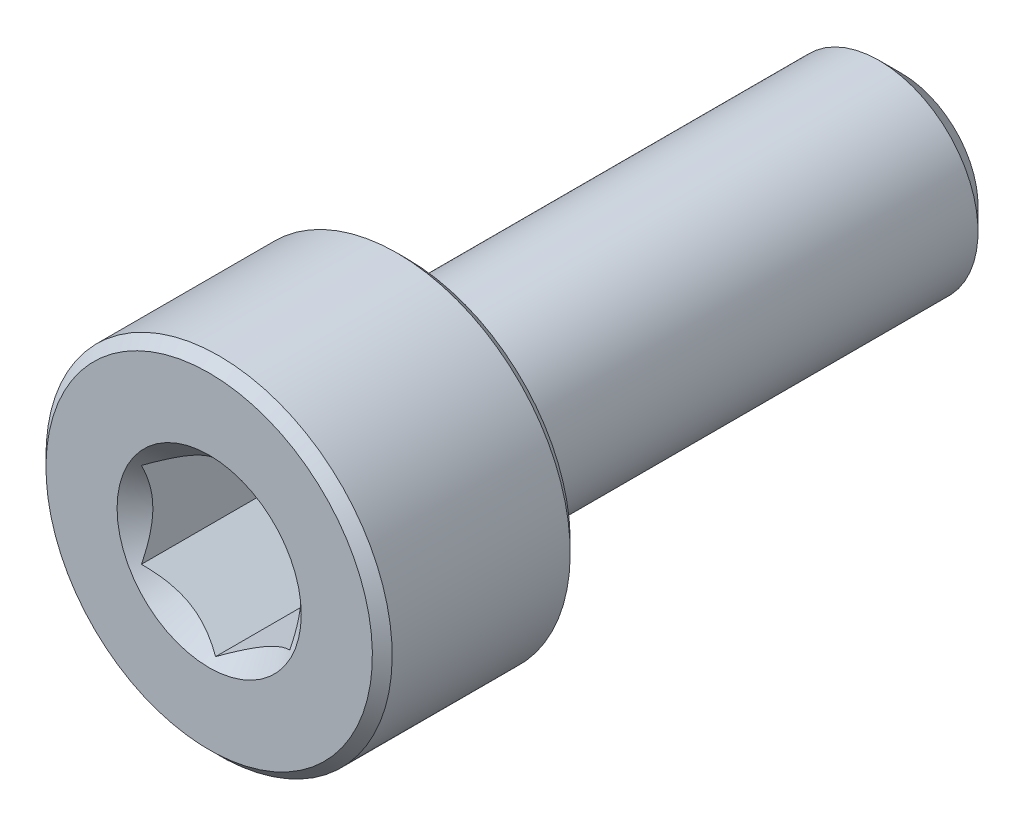
ISO-10303-21;
HEADER;
FILE_DESCRIPTION(('STEP AP214'),'2;1');
FILE_NAME('part.step','',(''),(''),'','','');
FILE_SCHEMA(('AUTOMOTIVE_DESIGN { 1 0 10303 214 1 1 1 1 }'));
ENDSEC;
DATA;
#1=APPLICATION_CONTEXT('core data for automotive mechanical design processes');
#2=APPLICATION_PROTOCOL_DEFINITION('international standard','automotive_design',2000,#1);
#3=PRODUCT_CONTEXT('',#1,'mechanical');
#4=PRODUCT('Part','Part','',(#3));
#5=PRODUCT_RELATED_PRODUCT_CATEGORY('part','',(#4));
#6=PRODUCT_DEFINITION_FORMATION('','',#4);
#7=PRODUCT_DEFINITION_CONTEXT('part definition',#1,'design');
#8=PRODUCT_DEFINITION('design','',#6,#7);
#9=PRODUCT_DEFINITION_SHAPE('','',#8);
#10=(LENGTH_UNIT() NAMED_UNIT(*) SI_UNIT(.MILLI.,.METRE.));
#11=(NAMED_UNIT(*) PLANE_ANGLE_UNIT() SI_UNIT($,.RADIAN.));
#12=(NAMED_UNIT(*) SI_UNIT($,.STERADIAN.) SOLID_ANGLE_UNIT());
#13=UNCERTAINTY_MEASURE_WITH_UNIT(LENGTH_MEASURE(1.E-05),#10,'distance_accuracy_value','');
#14=(GEOMETRIC_REPRESENTATION_CONTEXT(3) GLOBAL_UNCERTAINTY_ASSIGNED_CONTEXT((#13)) GLOBAL_UNIT_ASSIGNED_CONTEXT((#10,
#11,#12)) REPRESENTATION_CONTEXT('',''));
#15=CARTESIAN_POINT('',(0.,0.,0.));
#16=DIRECTION('',(0.,0.,1.));
#17=DIRECTION('',(1.,0.,0.));
#18=AXIS2_PLACEMENT_3D('',#15,#16,#17);
#19=CARTESIAN_POINT('',(0.,1.54533666301317,-7.));
#20=DIRECTION('',(0.,0.,-1.));
#21=DIRECTION('',(0.,1.,0.));
#22=AXIS2_PLACEMENT_3D('',#19,#20,#21);
#23=PLANE('',#22);
#24=CARTESIAN_POINT('',(0.,0.,-7.));
#25=DIRECTION('',(0.,0.,-1.));
#26=DIRECTION('',(0.,1.,0.));
#27=AXIS2_PLACEMENT_3D('',#24,#25,#26);
#28=CIRCLE('',#27,1.54533666301317);
#29=CARTESIAN_POINT('',(0.,1.54533666301317,-7.));
#30=VERTEX_POINT('',#29);
#31=EDGE_CURVE('E55',#30,#30,#28,.T.);
#32=ORIENTED_EDGE('',*,*,#31,.T.);
#33=EDGE_LOOP('',(#32));
#34=FACE_BOUND('',#33,.T.);
#35=ADVANCED_FACE('F41',(#34),#23,.T.);
#36=CARTESIAN_POINT('',(0.,0.,-7.));
#37=DIRECTION('',(0.,0.,1.));
#38=DIRECTION('',(0.,-1.,0.));
#39=AXIS2_PLACEMENT_3D('',#36,#37,#38);
#40=CONICAL_SURFACE('',#39,1.54533666301317,0.785398163397445);
#41=CARTESIAN_POINT('',(0.,0.,-6.54533666301317));
#42=DIRECTION('',(0.,0.,-1.));
#43=DIRECTION('',(0.,1.,0.));
#44=AXIS2_PLACEMENT_3D('',#41,#42,#43);
#45=CIRCLE('',#44,2.);
#46=CARTESIAN_POINT('',(0.,2.,-6.54533666301317));
#47=VERTEX_POINT('',#46);
#48=EDGE_CURVE('E173',#47,#47,#45,.T.);
#49=ORIENTED_EDGE('',*,*,#48,.T.);
#50=EDGE_LOOP('',(#49));
#51=FACE_BOUND('',#50,.T.);
#52=ORIENTED_EDGE('',*,*,#31,.F.);
#53=EDGE_LOOP('',(#52));
#54=FACE_BOUND('',#53,.T.);
#55=ADVANCED_FACE('F181',(#51,#54),#40,.T.);
#56=CARTESIAN_POINT('',(0.,0.,-7.));
#57=DIRECTION('',(0.,0.,-1.));
#58=DIRECTION('',(0.,1.,0.));
#59=AXIS2_PLACEMENT_3D('',#56,#57,#58);
#60=CYLINDRICAL_SURFACE('',#59,2.);
#61=CARTESIAN_POINT('',(0.,0.,2.8));
#62=DIRECTION('',(0.,0.,-1.));
#63=DIRECTION('',(0.,1.,0.));
#64=AXIS2_PLACEMENT_3D('',#61,#62,#63);
#65=CIRCLE('',#64,2.);
#66=CARTESIAN_POINT('',(0.,2.,2.8));
#67=VERTEX_POINT('',#66);
#68=EDGE_CURVE('E169',#67,#67,#65,.T.);
#69=ORIENTED_EDGE('',*,*,#68,.T.);
#70=EDGE_LOOP('',(#69));
#71=FACE_BOUND('',#70,.T.);
#72=ORIENTED_EDGE('',*,*,#48,.F.);
#73=EDGE_LOOP('',(#72));
#74=FACE_BOUND('',#73,.T.);
#75=ADVANCED_FACE('F183',(#71,#74),#60,.T.);
#76=CARTESIAN_POINT('',(0.,0.,2.8));
#77=DIRECTION('',(0.,0.,-1.));
#78=DIRECTION('',(0.,1.,0.));
#79=AXIS2_PLACEMENT_3D('',#76,#77,#78);
#80=TOROIDAL_SURFACE('',#79,2.2,0.2);
#81=CARTESIAN_POINT('',(0.,0.,3.));
#82=DIRECTION('',(0.,0.,-1.));
#83=DIRECTION('',(0.,1.,0.));
#84=AXIS2_PLACEMENT_3D('',#81,#82,#83);
#85=CIRCLE('',#84,2.2);
#86=CARTESIAN_POINT('',(0.,2.2,3.));
#87=VERTEX_POINT('',#86);
#88=EDGE_CURVE('E165',#87,#87,#85,.T.);
#89=ORIENTED_EDGE('',*,*,#88,.T.);
#90=EDGE_LOOP('',(#89));
#91=FACE_BOUND('',#90,.T.);
#92=ORIENTED_EDGE('',*,*,#68,.F.);
#93=EDGE_LOOP('',(#92));
#94=FACE_BOUND('',#93,.T.);
#95=ADVANCED_FACE('F189',(#91,#94),#80,.F.);
#96=CARTESIAN_POINT('',(0.,3.3,3.));
#97=DIRECTION('',(0.,0.,-1.));
#98=DIRECTION('',(0.,1.,0.));
#99=AXIS2_PLACEMENT_3D('',#96,#97,#98);
#100=PLANE('',#99);
#101=CARTESIAN_POINT('',(0.,0.,3.));
#102=DIRECTION('',(0.,0.,-1.));
#103=DIRECTION('',(0.,1.,0.));
#104=AXIS2_PLACEMENT_3D('',#101,#102,#103);
#105=CIRCLE('',#104,3.3);
#106=CARTESIAN_POINT('',(0.,3.3,3.));
#107=VERTEX_POINT('',#106);
#108=EDGE_CURVE('E161',#107,#107,#105,.T.);
#109=ORIENTED_EDGE('',*,*,#108,.T.);
#110=EDGE_LOOP('',(#109));
#111=FACE_BOUND('',#110,.T.);
#112=ORIENTED_EDGE('',*,*,#88,.F.);
#113=EDGE_LOOP('',(#112));
#114=FACE_BOUND('',#113,.T.);
#115=ADVANCED_FACE('F195',(#111,#114),#100,.T.);
#116=CARTESIAN_POINT('',(0.,0.,3.));
#117=DIRECTION('',(0.,0.,1.));
#118=DIRECTION('',(0.,-1.,0.));
#119=AXIS2_PLACEMENT_3D('',#116,#117,#118);
#120=CONICAL_SURFACE('',#119,3.3,0.785398163397447);
#121=CARTESIAN_POINT('',(0.,0.,3.2));
#122=DIRECTION('',(0.,0.,-1.));
#123=DIRECTION('',(0.,1.,0.));
#124=AXIS2_PLACEMENT_3D('',#121,#122,#123);
#125=CIRCLE('',#124,3.5);
#126=CARTESIAN_POINT('',(0.,3.5,3.2));
#127=VERTEX_POINT('',#126);
#128=EDGE_CURVE('E157',#127,#127,#125,.T.);
#129=ORIENTED_EDGE('',*,*,#128,.T.);
#130=EDGE_LOOP('',(#129));
#131=FACE_BOUND('',#130,.T.);
#132=ORIENTED_EDGE('',*,*,#108,.F.);
#133=EDGE_LOOP('',(#132));
#134=FACE_BOUND('',#133,.T.);
#135=ADVANCED_FACE('F199',(#131,#134),#120,.T.);
#136=CARTESIAN_POINT('',(0.,0.,-7.));
#137=DIRECTION('',(0.,0.,-1.));
#138=DIRECTION('',(0.,1.,0.));
#139=AXIS2_PLACEMENT_3D('',#136,#137,#138);
#140=CYLINDRICAL_SURFACE('',#139,3.5);
#141=CARTESIAN_POINT('',(0.,0.,6.8));
#142=DIRECTION('',(0.,0.,-1.));
#143=DIRECTION('',(0.,1.,0.));
#144=AXIS2_PLACEMENT_3D('',#141,#142,#143);
#145=CIRCLE('',#144,3.5);
#146=CARTESIAN_POINT('',(0.,3.5,6.8));
#147=VERTEX_POINT('',#146);
#148=EDGE_CURVE('E153',#147,#147,#145,.T.);
#149=ORIENTED_EDGE('',*,*,#148,.T.);
#150=EDGE_LOOP('',(#149));
#151=FACE_BOUND('',#150,.T.);
#152=ORIENTED_EDGE('',*,*,#128,.F.);
#153=EDGE_LOOP('',(#152));
#154=FACE_BOUND('',#153,.T.);
#155=ADVANCED_FACE('F203',(#151,#154),#140,.T.);
#156=CARTESIAN_POINT('',(0.,0.,6.8));
#157=DIRECTION('',(0.,0.,-1.));
#158=DIRECTION('',(0.,1.,0.));
#159=AXIS2_PLACEMENT_3D('',#156,#157,#158);
#160=CONICAL_SURFACE('',#159,3.5,0.785398163397447);
#161=CARTESIAN_POINT('',(0.,0.,7.));
#162=DIRECTION('',(0.,0.,-1.));
#163=DIRECTION('',(0.,1.,0.));
#164=AXIS2_PLACEMENT_3D('',#161,#162,#163);
#165=CIRCLE('',#164,3.3);
#166=CARTESIAN_POINT('',(0.,3.3,7.));
#167=VERTEX_POINT('',#166);
#168=EDGE_CURVE('E149',#167,#167,#165,.T.);
#169=ORIENTED_EDGE('',*,*,#168,.T.);
#170=EDGE_LOOP('',(#169));
#171=FACE_BOUND('',#170,.T.);
#172=ORIENTED_EDGE('',*,*,#148,.F.);
#173=EDGE_LOOP('',(#172));
#174=FACE_BOUND('',#173,.T.);
#175=ADVANCED_FACE('F207',(#171,#174),#160,.T.);
#176=CARTESIAN_POINT('',(0.,0.,7.));
#177=DIRECTION('',(0.,0.,1.));
#178=DIRECTION('',(0.,-1.,0.));
#179=AXIS2_PLACEMENT_3D('',#176,#177,#178);
#180=PLANE('',#179);
#181=CARTESIAN_POINT('',(0.,0.,7.));
#182=DIRECTION('',(0.,0.,1.));
#183=DIRECTION('',(1.,0.,0.));
#184=AXIS2_PLACEMENT_3D('',#181,#182,#183);
#185=CIRCLE('',#184,1.86195461813654);
#186=CARTESIAN_POINT('',(1.86195461813654,0.,7.));
#187=VERTEX_POINT('',#186);
#188=EDGE_CURVE('E115',#187,#187,#185,.T.);
#189=ORIENTED_EDGE('',*,*,#188,.F.);
#190=EDGE_LOOP('',(#189));
#191=FACE_BOUND('',#190,.T.);
#192=ORIENTED_EDGE('',*,*,#168,.F.);
#193=EDGE_LOOP('',(#192));
#194=FACE_BOUND('',#193,.T.);
#195=ADVANCED_FACE('F211',(#191,#194),#180,.T.);
#196=CARTESIAN_POINT('',(0.,0.,7.));
#197=DIRECTION('',(0.,0.,1.));
#198=DIRECTION('',(1.,0.,0.));
#199=AXIS2_PLACEMENT_3D('',#196,#197,#198);
#200=CONICAL_SURFACE('',#199,1.86195461813654,0.78539816339745);
#201=ORIENTED_EDGE('',*,*,#188,.T.);
#202=EDGE_LOOP('',(#201));
#203=FACE_BOUND('',#202,.T.);
#204=CARTESIAN_POINT('',(-0.000199999999999562,-1.73216627762272,6.87021167103241));
#205=CARTESIAN_POINT('',(0.051367790737076,-1.70239359975915,6.84046166549966));
#206=CARTESIAN_POINT('',(0.103797917665201,-1.67212305186355,6.81245867334265));
#207=CARTESIAN_POINT('',(0.210709034055597,-1.61039789003619,6.76118541987248));
#208=CARTESIAN_POINT('',(0.265200195814661,-1.57893740312614,6.73794369447671));
#209=CARTESIAN_POINT('',(0.375079081357249,-1.51549879897987,6.69812991842456));
#210=CARTESIAN_POINT('',(0.4304388090952,-1.4835368452681,6.68145777510323));
#211=CARTESIAN_POINT('',(0.542377257477151,-1.41890915196211,6.65577064625044));
#212=CARTESIAN_POINT('',(0.598952556553009,-1.38624538781118,6.6467364799112));
#213=CARTESIAN_POINT('',(0.696455389516441,-1.32995210095299,6.63858527065919));
#214=CARTESIAN_POINT('',(0.737256908280467,-1.30639533311124,6.63737844242155));
#215=CARTESIAN_POINT('',(0.818787969615859,-1.25932335290193,6.6394102465946));
#216=CARTESIAN_POINT('',(0.859517494314631,-1.23580815085313,6.64264986018064));
#217=CARTESIAN_POINT('',(0.940584402163417,-1.18900414978427,6.6533881754143));
#218=CARTESIAN_POINT('',(0.980921384598289,-1.1657155821172,6.66089084245107));
#219=CARTESIAN_POINT('',(1.06091833691403,-1.11952932016335,6.67974780136063));
#220=CARTESIAN_POINT('',(1.10057800851621,-1.09663179808786,6.69110374645092));
#221=CARTESIAN_POINT('',(1.20216313477449,-1.03798159809698,6.72481783702501));
#222=CARTESIAN_POINT('',(1.26345855370969,-1.00259267147465,6.7497180385257));
#223=CARTESIAN_POINT('',(1.35358562846331,-0.950557780604375,6.79175284270391));
#224=CARTESIAN_POINT('',(1.38328513990772,-0.933410759677147,6.80652134299143));
#225=CARTESIAN_POINT('',(1.44213790138375,-0.899432101996407,6.8374067553725));
#226=CARTESIAN_POINT('',(1.47129140422064,-0.88260031928571,6.85352302355405));
#227=CARTESIAN_POINT('',(1.5002,-0.865909933730601,6.87021167103241));
#228=B_SPLINE_CURVE_WITH_KNOTS('',3,(#204,#205,#206,#207,#208,#209,#210,#211,#212,#213,#214,
#215,#216,#217,#218,#219,#220,#221,#222,#223,#224,#225,#226,#227),.UNSPECIFIED.,.F.,.F.,(4,2,2,
2,2,2,2,2,2,2,2,4),(0.,0.199829143693305,0.400822987382388,0.598623720538181,0.79592624018889,
0.937113067959882,1.07833105577193,1.21968061668222,1.36109089931054,1.58570969637565,
1.69770705470964,1.80965120737194),.UNSPECIFIED.);
#229=CARTESIAN_POINT('',(0.,-1.73205080756888,6.87009618943233));
#230=VERTEX_POINT('',#229);
#231=CARTESIAN_POINT('',(1.5,-0.866025403784439,6.87009618943233));
#232=VERTEX_POINT('',#231);
#233=EDGE_CURVE('E12',#230,#232,#228,.T.);
#234=ORIENTED_EDGE('',*,*,#233,.F.);
#235=CARTESIAN_POINT('',(-1.5002,-0.865909933730601,6.87021167103241));
#236=CARTESIAN_POINT('',(-1.44863220926292,-0.895682611594166,6.84046166549966));
#237=CARTESIAN_POINT('',(-1.3962020823348,-0.925953159489765,6.81245867334265));
#238=CARTESIAN_POINT('',(-1.2892909659444,-0.987678321317124,6.76118541987248));
#239=CARTESIAN_POINT('',(-1.23479980418534,-1.01913880822718,6.73794369447671));
#240=CARTESIAN_POINT('',(-1.12492091864275,-1.08257741237344,6.69812991842456));
#241=CARTESIAN_POINT('',(-1.0695611909048,-1.11453936608521,6.68145777510323));
#242=CARTESIAN_POINT('',(-0.957622742522849,-1.1791670593912,6.65577064625044));
#243=CARTESIAN_POINT('',(-0.901047443446991,-1.21183082354213,6.6467364799112));
#244=CARTESIAN_POINT('',(-0.803544610483559,-1.26812411040032,6.63858527065919));
#245=CARTESIAN_POINT('',(-0.762743091719534,-1.29168087824208,6.63737844242155));
#246=CARTESIAN_POINT('',(-0.681212030384142,-1.33875285845138,6.6394102465946));
#247=CARTESIAN_POINT('',(-0.64048250568537,-1.36226806050018,6.64264986018064));
#248=CARTESIAN_POINT('',(-0.559415597836584,-1.40907206156905,6.6533881754143));
#249=CARTESIAN_POINT('',(-0.519078615401712,-1.43236062923612,6.66089084245107));
#250=CARTESIAN_POINT('',(-0.439081663085969,-1.47854689118996,6.67974780136063));
#251=CARTESIAN_POINT('',(-0.399421991483792,-1.50144441326545,6.69110374645092));
#252=CARTESIAN_POINT('',(-0.297836865225515,-1.56009461325633,6.72481783702501));
#253=CARTESIAN_POINT('',(-0.236541446290311,-1.59548353987866,6.7497180385257));
#254=CARTESIAN_POINT('',(-0.146414371536686,-1.64751843074894,6.79175284270391));
#255=CARTESIAN_POINT('',(-0.116714860092282,-1.66466545167617,6.80652134299143));
#256=CARTESIAN_POINT('',(-0.0578620986162482,-1.69864410935691,6.8374067553725));
#257=CARTESIAN_POINT('',(-0.0287085957793619,-1.71547589206761,6.85352302355405));
#258=CARTESIAN_POINT('',(0.00020000000000074,-1.73216627762272,6.87021167103241));
#259=B_SPLINE_CURVE_WITH_KNOTS('',3,(#235,#236,#237,#238,#239,#240,#241,#242,#243,#244,#245,
#246,#247,#248,#249,#250,#251,#252,#253,#254,#255,#256,#257,#258),.UNSPECIFIED.,.F.,.F.,(4,2,2,
2,2,2,2,2,2,2,2,4),(0.,0.199829143693305,0.400822987382388,0.598623720538181,0.795926240188889,
0.937113067959881,1.07833105577193,1.21968061668222,1.36109089931054,1.58570969637566,
1.69770705470964,1.80965120737194),.UNSPECIFIED.);
#260=CARTESIAN_POINT('',(-1.5,-0.866025403784439,6.87009618943233));
#261=VERTEX_POINT('',#260);
#262=EDGE_CURVE('E100',#261,#230,#259,.T.);
#263=ORIENTED_EDGE('',*,*,#262,.F.);
#264=CARTESIAN_POINT('',(-1.5,-1.81798631684901,7.49496588290931));
#265=CARTESIAN_POINT('',(-1.5,-1.77410479833239,7.46112335419702));
#266=CARTESIAN_POINT('',(-1.5,-1.72998897047494,7.42758561768896));
#267=CARTESIAN_POINT('',(-1.5,-1.64119029432319,7.36124817349269));
#268=CARTESIAN_POINT('',(-1.5,-1.59650731534755,7.328448640911));
#269=CARTESIAN_POINT('',(-1.5,-1.460806940489,7.23088193148043));
#270=CARTESIAN_POINT('',(-1.5,-1.36880251235632,7.1674654206559));
#271=CARTESIAN_POINT('',(-1.5,-1.17526237686872,7.04210237172158));
#272=CARTESIAN_POINT('',(-1.5,-1.07349393006072,6.98051141536721));
#273=CARTESIAN_POINT('',(-1.5,-0.864764842560627,6.86725220599653));
#274=CARTESIAN_POINT('',(-1.5,-0.757823334449949,6.81555043950584));
#275=CARTESIAN_POINT('',(-1.5,-0.598146069886858,6.75227317361643));
#276=CARTESIAN_POINT('',(-1.5,-0.547969945491557,6.73427408399124));
#277=CARTESIAN_POINT('',(-1.5,-0.446326869364774,6.70229546522083));
#278=CARTESIAN_POINT('',(-1.5,-0.394859836419925,6.68831618966241));
#279=CARTESIAN_POINT('',(-1.5,-0.291848397493325,6.66536569037263));
#280=CARTESIAN_POINT('',(-1.5,-0.240324749628771,6.65630281543282));
#281=CARTESIAN_POINT('',(-1.5,-0.13662544851591,6.64337711521516));
#282=CARTESIAN_POINT('',(-1.5,-0.0844499362377799,6.6395131846234));
#283=CARTESIAN_POINT('',(-1.5,0.0176806967011132,6.63731961256892));
#284=CARTESIAN_POINT('',(-1.5,0.0676307045116617,6.63875006923659));
#285=CARTESIAN_POINT('',(-1.5,0.16714547763776,6.64651331423855));
#286=CARTESIAN_POINT('',(-1.5,0.216710207908513,6.6528465433779));
#287=CARTESIAN_POINT('',(-1.5,0.315937150651982,6.67016271707146));
#288=CARTESIAN_POINT('',(-1.5,0.365584733694539,6.68122815181031));
#289=CARTESIAN_POINT('',(-1.5,0.46378160619877,6.70739349919908));
#290=CARTESIAN_POINT('',(-1.5,0.512330953840259,6.72249319758548));
#291=CARTESIAN_POINT('',(-1.5,0.66131302328769,6.77461385569168));
#292=CARTESIAN_POINT('',(-1.5,0.759720789706277,6.81740496304236));
#293=CARTESIAN_POINT('',(-1.5,0.95194266902277,6.91263883721007));
#294=CARTESIAN_POINT('',(-1.5,1.04573912191844,6.96511552648595));
#295=CARTESIAN_POINT('',(-1.5,1.22504153577549,7.0734783373155));
#296=CARTESIAN_POINT('',(-1.5,1.3107282773288,7.12906910554414));
#297=CARTESIAN_POINT('',(-1.5,1.43696960041027,7.21505045621636));
#298=CARTESIAN_POINT('',(-1.5,1.47850725450332,7.24402268297088));
#299=CARTESIAN_POINT('',(-1.5,1.56101250374723,7.30274488393776));
#300=CARTESIAN_POINT('',(-1.5,1.60198025290925,7.33249464151831));
#301=CARTESIAN_POINT('',(-1.5,1.64271029717086,7.36256715528604));
#302=B_SPLINE_CURVE_WITH_KNOTS('',3,(#264,#265,#266,#267,#268,#269,#270,#271,#272,#273,#274,
#275,#276,#277,#278,#279,#280,#281,#282,#283,#284,#285,#286,#287,#288,#289,#290,#291,#292,#293,
#294,#295,#296,#297,#298,#299,#300,#301),.UNSPECIFIED.,.F.,.F.,(4,2,2,2,2,2,2,2,2,2,2,2,2,2,2,2,
2,2,4),(0.,0.166243250325255,0.332525527595494,0.667617582874064,1.02421660314856,
1.37958485991001,1.53937185590113,1.69916892971772,1.85587466130012,2.01254707142443,
2.16220898927398,2.31188436469119,2.46428258498153,2.61667271286895,2.93766301623296,
3.25979964661299,3.56606529199603,3.71798989158865,3.86987260467919),.UNSPECIFIED.);
#303=CARTESIAN_POINT('',(-1.5,0.866025403784439,6.87009618943233));
#304=VERTEX_POINT('',#303);
#305=EDGE_CURVE('E114',#304,#261,#302,.F.);
#306=ORIENTED_EDGE('',*,*,#305,.F.);
#307=CARTESIAN_POINT('',(0.00019999999999977,1.73216627762272,6.87021167103241));
#308=CARTESIAN_POINT('',(-0.0513677907370758,1.70239359975915,6.84046166549966));
#309=CARTESIAN_POINT('',(-0.103797917665201,1.67212305186355,6.81245867334265));
#310=CARTESIAN_POINT('',(-0.210709034055597,1.61039789003619,6.76118541987248));
#311=CARTESIAN_POINT('',(-0.265200195814661,1.57893740312614,6.73794369447671));
#312=CARTESIAN_POINT('',(-0.375079081357249,1.51549879897987,6.69812991842456));
#313=CARTESIAN_POINT('',(-0.4304388090952,1.4835368452681,6.68145777510323));
#314=CARTESIAN_POINT('',(-0.542377257477151,1.41890915196211,6.65577064625044));
#315=CARTESIAN_POINT('',(-0.598952556553009,1.38624538781118,6.6467364799112));
#316=CARTESIAN_POINT('',(-0.696455389516441,1.32995210095299,6.63858527065919));
#317=CARTESIAN_POINT('',(-0.737256908280467,1.30639533311124,6.63737844242155));
#318=CARTESIAN_POINT('',(-0.818787969615859,1.25932335290193,6.6394102465946));
#319=CARTESIAN_POINT('',(-0.859517494314631,1.23580815085313,6.64264986018064));
#320=CARTESIAN_POINT('',(-0.940584402163417,1.18900414978427,6.6533881754143));
#321=CARTESIAN_POINT('',(-0.980921384598289,1.16571558211719,6.66089084245107));
#322=CARTESIAN_POINT('',(-1.06091833691403,1.11952932016335,6.67974780136063));
#323=CARTESIAN_POINT('',(-1.10057800851621,1.09663179808786,6.69110374645092));
#324=CARTESIAN_POINT('',(-1.20216313477449,1.03798159809698,6.72481783702501));
#325=CARTESIAN_POINT('',(-1.26345855370969,1.00259267147465,6.7497180385257));
#326=CARTESIAN_POINT('',(-1.35358562846331,0.950557780604374,6.79175284270391));
#327=CARTESIAN_POINT('',(-1.38328513990772,0.933410759677147,6.80652134299143));
#328=CARTESIAN_POINT('',(-1.44213790138375,0.899432101996406,6.8374067553725));
#329=CARTESIAN_POINT('',(-1.47129140422064,0.88260031928571,6.85352302355405));
#330=CARTESIAN_POINT('',(-1.5002,0.865909933730601,6.87021167103241));
#331=B_SPLINE_CURVE_WITH_KNOTS('',3,(#307,#308,#309,#310,#311,#312,#313,#314,#315,#316,#317,
#318,#319,#320,#321,#322,#323,#324,#325,#326,#327,#328,#329,#330),.UNSPECIFIED.,.F.,.F.,(4,2,2,
2,2,2,2,2,2,2,2,4),(0.,0.199829143693305,0.400822987382389,0.598623720538181,0.79592624018889,
0.937113067959882,1.07833105577193,1.21968061668222,1.36109089931055,1.58570969637566,
1.69770705470964,1.80965120737194),.UNSPECIFIED.);
#332=CARTESIAN_POINT('',(0.,1.73205080756888,6.87009618943233));
#333=VERTEX_POINT('',#332);
#334=EDGE_CURVE('E262',#333,#304,#331,.T.);
#335=ORIENTED_EDGE('',*,*,#334,.F.);
#336=CARTESIAN_POINT('',(1.5002,0.865909933730601,6.87021167103241));
#337=CARTESIAN_POINT('',(1.44863220926292,0.895682611594166,6.84046166549966));
#338=CARTESIAN_POINT('',(1.3962020823348,0.925953159489765,6.81245867334265));
#339=CARTESIAN_POINT('',(1.2892909659444,0.987678321317124,6.76118541987248));
#340=CARTESIAN_POINT('',(1.23479980418534,1.01913880822718,6.73794369447671));
#341=CARTESIAN_POINT('',(1.12492091864275,1.08257741237344,6.69812991842455));
#342=CARTESIAN_POINT('',(1.0695611909048,1.11453936608521,6.68145777510323));
#343=CARTESIAN_POINT('',(0.957622742522849,1.1791670593912,6.65577064625044));
#344=CARTESIAN_POINT('',(0.901047443446991,1.21183082354213,6.6467364799112));
#345=CARTESIAN_POINT('',(0.803544610483559,1.26812411040032,6.63858527065919));
#346=CARTESIAN_POINT('',(0.762743091719534,1.29168087824208,6.63737844242155));
#347=CARTESIAN_POINT('',(0.681212030384142,1.33875285845138,6.6394102465946));
#348=CARTESIAN_POINT('',(0.64048250568537,1.36226806050018,6.64264986018064));
#349=CARTESIAN_POINT('',(0.559415597836584,1.40907206156905,6.6533881754143));
#350=CARTESIAN_POINT('',(0.519078615401712,1.43236062923612,6.66089084245107));
#351=CARTESIAN_POINT('',(0.439081663085969,1.47854689118996,6.67974780136063));
#352=CARTESIAN_POINT('',(0.399421991483792,1.50144441326545,6.69110374645092));
#353=CARTESIAN_POINT('',(0.297836865225515,1.56009461325633,6.72481783702501));
#354=CARTESIAN_POINT('',(0.23654144629031,1.59548353987866,6.7497180385257));
#355=CARTESIAN_POINT('',(0.146414371536686,1.64751843074894,6.79175284270391));
#356=CARTESIAN_POINT('',(0.116714860092281,1.66466545167617,6.80652134299143));
#357=CARTESIAN_POINT('',(0.0578620986162482,1.69864410935691,6.8374067553725));
#358=CARTESIAN_POINT('',(0.028708595779362,1.71547589206761,6.85352302355405));
#359=CARTESIAN_POINT('',(-0.000200000000000716,1.73216627762272,6.87021167103241));
#360=B_SPLINE_CURVE_WITH_KNOTS('',3,(#336,#337,#338,#339,#340,#341,#342,#343,#344,#345,#346,
#347,#348,#349,#350,#351,#352,#353,#354,#355,#356,#357,#358,#359),.UNSPECIFIED.,.F.,.F.,(4,2,2,
2,2,2,2,2,2,2,2,4),(0.,0.199829143693305,0.400822987382389,0.598623720538181,0.795926240188889,
0.937113067959881,1.07833105577193,1.21968061668222,1.36109089931054,1.58570969637566,
1.69770705470964,1.80965120737194),.UNSPECIFIED.);
#361=CARTESIAN_POINT('',(1.5,0.866025403784439,6.87009618943233));
#362=VERTEX_POINT('',#361);
#363=EDGE_CURVE('E235',#362,#333,#360,.T.);
#364=ORIENTED_EDGE('',*,*,#363,.F.);
#365=CARTESIAN_POINT('',(1.5,-1.81798631684901,7.49496588290931));
#366=CARTESIAN_POINT('',(1.5,-1.77410479833239,7.46112335419702));
#367=CARTESIAN_POINT('',(1.5,-1.72998897047494,7.42758561768896));
#368=CARTESIAN_POINT('',(1.5,-1.64119029432319,7.36124817349268));
#369=CARTESIAN_POINT('',(1.5,-1.59650731534755,7.328448640911));
#370=CARTESIAN_POINT('',(1.5,-1.460806940489,7.23088193148043));
#371=CARTESIAN_POINT('',(1.5,-1.36880251235632,7.1674654206559));
#372=CARTESIAN_POINT('',(1.5,-1.17526237686872,7.04210237172158));
#373=CARTESIAN_POINT('',(1.5,-1.07349393006072,6.98051141536721));
#374=CARTESIAN_POINT('',(1.5,-0.864764842560628,6.86725220599653));
#375=CARTESIAN_POINT('',(1.5,-0.757823334449949,6.81555043950584));
#376=CARTESIAN_POINT('',(1.5,-0.598146069886858,6.75227317361643));
#377=CARTESIAN_POINT('',(1.5,-0.547969945491557,6.73427408399124));
#378=CARTESIAN_POINT('',(1.5,-0.446326869364774,6.70229546522083));
#379=CARTESIAN_POINT('',(1.5,-0.394859836419925,6.68831618966241));
#380=CARTESIAN_POINT('',(1.5,-0.291848397493325,6.66536569037263));
#381=CARTESIAN_POINT('',(1.5,-0.240324749628771,6.65630281543282));
#382=CARTESIAN_POINT('',(1.5,-0.13662544851591,6.64337711521516));
#383=CARTESIAN_POINT('',(1.5,-0.08444993623778,6.6395131846234));
#384=CARTESIAN_POINT('',(1.5,0.0176806967011129,6.63731961256892));
#385=CARTESIAN_POINT('',(1.5,0.0676307045116614,6.63875006923659));
#386=CARTESIAN_POINT('',(1.5,0.16714547763776,6.64651331423855));
#387=CARTESIAN_POINT('',(1.5,0.216710207908513,6.6528465433779));
#388=CARTESIAN_POINT('',(1.5,0.315937150651982,6.67016271707146));
#389=CARTESIAN_POINT('',(1.5,0.365584733694538,6.68122815181031));
#390=CARTESIAN_POINT('',(1.5,0.463781606198769,6.70739349919908));
#391=CARTESIAN_POINT('',(1.5,0.512330953840258,6.72249319758548));
#392=CARTESIAN_POINT('',(1.5,0.661313023287689,6.77461385569168));
#393=CARTESIAN_POINT('',(1.5,0.759720789706276,6.81740496304236));
#394=CARTESIAN_POINT('',(1.5,0.951942669022769,6.91263883721007));
#395=CARTESIAN_POINT('',(1.5,1.04573912191844,6.96511552648595));
#396=CARTESIAN_POINT('',(1.5,1.22504153577548,7.0734783373155));
#397=CARTESIAN_POINT('',(1.5,1.3107282773288,7.12906910554414));
#398=CARTESIAN_POINT('',(1.5,1.43696960041027,7.21505045621636));
#399=CARTESIAN_POINT('',(1.5,1.47850725450332,7.24402268297088));
#400=CARTESIAN_POINT('',(1.5,1.56101250374723,7.30274488393776));
#401=CARTESIAN_POINT('',(1.5,1.60198025290925,7.3324946415183));
#402=CARTESIAN_POINT('',(1.5,1.64271029717086,7.36256715528604));
#403=B_SPLINE_CURVE_WITH_KNOTS('',3,(#365,#366,#367,#368,#369,#370,#371,#372,#373,#374,#375,
#376,#377,#378,#379,#380,#381,#382,#383,#384,#385,#386,#387,#388,#389,#390,#391,#392,#393,#394,
#395,#396,#397,#398,#399,#400,#401,#402),.UNSPECIFIED.,.F.,.F.,(4,2,2,2,2,2,2,2,2,2,2,2,2,2,2,2,
2,2,4),(0.,0.166243250325254,0.332525527595493,0.667617582874062,1.02421660314856,
1.37958485991001,1.53937185590113,1.69916892971772,1.85587466130012,2.01254707142443,
2.16220898927398,2.31188436469119,2.46428258498153,2.61667271286894,2.93766301623296,
3.25979964661299,3.56606529199602,3.71798989158864,3.86987260467919),.UNSPECIFIED.);
#404=EDGE_CURVE('E62',#232,#362,#403,.T.);
#405=ORIENTED_EDGE('',*,*,#404,.F.);
#406=EDGE_LOOP('',(#234,#263,#306,#335,#364,#405));
#407=FACE_BOUND('',#406,.T.);
#408=ADVANCED_FACE('F99',(#203,#407),#200,.F.);
#409=CARTESIAN_POINT('',(0.,3.3,4.));
#410=DIRECTION('',(0.,0.,-1.));
#411=DIRECTION('',(0.,1.,0.));
#412=AXIS2_PLACEMENT_3D('',#409,#410,#411);
#413=PLANE('',#412);
#414=DIRECTION('',(0.866025403784438,0.5,0.));
#415=VECTOR('',#414,1.);
#416=CARTESIAN_POINT('',(0.,-1.73205080756888,4.));
#417=LINE('',#416,#415);
#418=CARTESIAN_POINT('',(0.,-1.73205080756888,4.));
#419=VERTEX_POINT('',#418);
#420=CARTESIAN_POINT('',(1.5,-0.866025403784439,4.));
#421=VERTEX_POINT('',#420);
#422=EDGE_CURVE('E118',#419,#421,#417,.T.);
#423=ORIENTED_EDGE('',*,*,#422,.T.);
#424=DIRECTION('',(0.,1.,0.));
#425=VECTOR('',#424,1.);
#426=CARTESIAN_POINT('',(1.5,-0.866025403784439,4.));
#427=LINE('',#426,#425);
#428=CARTESIAN_POINT('',(1.5,0.866025403784439,4.));
#429=VERTEX_POINT('',#428);
#430=EDGE_CURVE('E69',#421,#429,#427,.T.);
#431=ORIENTED_EDGE('',*,*,#430,.T.);
#432=DIRECTION('',(-0.866025403784439,0.5,0.));
#433=VECTOR('',#432,1.);
#434=CARTESIAN_POINT('',(1.5,0.866025403784439,4.));
#435=LINE('',#434,#433);
#436=CARTESIAN_POINT('',(0.,1.73205080756888,4.));
#437=VERTEX_POINT('',#436);
#438=EDGE_CURVE('E129',#429,#437,#435,.T.);
#439=ORIENTED_EDGE('',*,*,#438,.T.);
#440=DIRECTION('',(-0.866025403784439,-0.5,0.));
#441=VECTOR('',#440,1.);
#442=CARTESIAN_POINT('',(0.,1.73205080756888,4.));
#443=LINE('',#442,#441);
#444=CARTESIAN_POINT('',(-1.5,0.866025403784439,4.));
#445=VERTEX_POINT('',#444);
#446=EDGE_CURVE('E138',#437,#445,#443,.T.);
#447=ORIENTED_EDGE('',*,*,#446,.T.);
#448=DIRECTION('',(0.,-1.,0.));
#449=VECTOR('',#448,1.);
#450=CARTESIAN_POINT('',(-1.5,0.866025403784438,4.));
#451=LINE('',#450,#449);
#452=CARTESIAN_POINT('',(-1.5,-0.866025403784439,4.));
#453=VERTEX_POINT('',#452);
#454=EDGE_CURVE('E133',#445,#453,#451,.T.);
#455=ORIENTED_EDGE('',*,*,#454,.T.);
#456=DIRECTION('',(0.866025403784439,-0.5,0.));
#457=VECTOR('',#456,1.);
#458=CARTESIAN_POINT('',(-1.5,-0.866025403784439,4.));
#459=LINE('',#458,#457);
#460=EDGE_CURVE('E120',#453,#419,#459,.T.);
#461=ORIENTED_EDGE('',*,*,#460,.T.);
#462=EDGE_LOOP('',(#423,#431,#439,#447,#455,#461));
#463=FACE_BOUND('',#462,.T.);
#464=ADVANCED_FACE('F216',(#463),#413,.F.);
#465=CARTESIAN_POINT('',(0.,-1.73205080756888,-1.58257569495584));
#466=DIRECTION('',(0.5,-0.866025403784438,0.));
#467=DIRECTION('',(0.866025403784438,0.5,0.));
#468=AXIS2_PLACEMENT_3D('',#465,#466,#467);
#469=PLANE('',#468);
#470=DIRECTION('',(0.,0.,1.));
#471=VECTOR('',#470,1.);
#472=CARTESIAN_POINT('',(0.,-1.73205080756888,-1.58257569495584));
#473=LINE('',#472,#471);
#474=EDGE_CURVE('E109',#419,#230,#473,.T.);
#475=ORIENTED_EDGE('',*,*,#474,.T.);
#476=ORIENTED_EDGE('',*,*,#233,.T.);
#477=DIRECTION('',(0.,0.,1.));
#478=VECTOR('',#477,1.);
#479=CARTESIAN_POINT('',(1.5,-0.866025403784439,-1.58257569495584));
#480=LINE('',#479,#478);
#481=EDGE_CURVE('E124',#421,#232,#480,.T.);
#482=ORIENTED_EDGE('',*,*,#481,.F.);
#483=ORIENTED_EDGE('',*,*,#422,.F.);
#484=EDGE_LOOP('',(#475,#476,#482,#483));
#485=FACE_BOUND('',#484,.T.);
#486=ADVANCED_FACE('F117',(#485),#469,.F.);
#487=CARTESIAN_POINT('',(-1.5,-0.866025403784439,-1.58257569495584));
#488=DIRECTION('',(-0.5,-0.866025403784439,0.));
#489=DIRECTION('',(0.866025403784439,-0.5,0.));
#490=AXIS2_PLACEMENT_3D('',#487,#488,#489);
#491=PLANE('',#490);
#492=DIRECTION('',(0.,0.,1.));
#493=VECTOR('',#492,1.);
#494=CARTESIAN_POINT('',(-1.5,-0.866025403784439,-1.58257569495584));
#495=LINE('',#494,#493);
#496=EDGE_CURVE('E112',#453,#261,#495,.T.);
#497=ORIENTED_EDGE('',*,*,#496,.T.);
#498=ORIENTED_EDGE('',*,*,#262,.T.);
#499=ORIENTED_EDGE('',*,*,#474,.F.);
#500=ORIENTED_EDGE('',*,*,#460,.F.);
#501=EDGE_LOOP('',(#497,#498,#499,#500));
#502=FACE_BOUND('',#501,.T.);
#503=ADVANCED_FACE('F108',(#502),#491,.F.);
#504=CARTESIAN_POINT('',(-1.5,0.866025403784438,-1.58257569495584));
#505=DIRECTION('',(-1.,0.,0.));
#506=DIRECTION('',(0.,0.,1.));
#507=AXIS2_PLACEMENT_3D('',#504,#505,#506);
#508=PLANE('',#507);
#509=DIRECTION('',(0.,0.,1.));
#510=VECTOR('',#509,1.);
#511=CARTESIAN_POINT('',(-1.5,0.866025403784438,-1.58257569495584));
#512=LINE('',#511,#510);
#513=EDGE_CURVE('E134',#445,#304,#512,.T.);
#514=ORIENTED_EDGE('',*,*,#513,.T.);
#515=ORIENTED_EDGE('',*,*,#305,.T.);
#516=ORIENTED_EDGE('',*,*,#496,.F.);
#517=ORIENTED_EDGE('',*,*,#454,.F.);
#518=EDGE_LOOP('',(#514,#515,#516,#517));
#519=FACE_BOUND('',#518,.T.);
#520=ADVANCED_FACE('F272',(#519),#508,.F.);
#521=CARTESIAN_POINT('',(0.,1.73205080756888,-1.58257569495584));
#522=DIRECTION('',(-0.5,0.866025403784438,0.));
#523=DIRECTION('',(-0.866025403784439,-0.5,0.));
#524=AXIS2_PLACEMENT_3D('',#521,#522,#523);
#525=PLANE('',#524);
#526=DIRECTION('',(0.,0.,1.));
#527=VECTOR('',#526,1.);
#528=CARTESIAN_POINT('',(0.,1.73205080756888,-1.58257569495584));
#529=LINE('',#528,#527);
#530=EDGE_CURVE('E139',#437,#333,#529,.T.);
#531=ORIENTED_EDGE('',*,*,#530,.T.);
#532=ORIENTED_EDGE('',*,*,#334,.T.);
#533=ORIENTED_EDGE('',*,*,#513,.F.);
#534=ORIENTED_EDGE('',*,*,#446,.F.);
#535=EDGE_LOOP('',(#531,#532,#533,#534));
#536=FACE_BOUND('',#535,.T.);
#537=ADVANCED_FACE('F269',(#536),#525,.F.);
#538=CARTESIAN_POINT('',(1.5,0.866025403784439,-1.58257569495584));
#539=DIRECTION('',(0.5,0.866025403784439,0.));
#540=DIRECTION('',(-0.866025403784439,0.5,0.));
#541=AXIS2_PLACEMENT_3D('',#538,#539,#540);
#542=PLANE('',#541);
#543=DIRECTION('',(0.,0.,1.));
#544=VECTOR('',#543,1.);
#545=CARTESIAN_POINT('',(1.5,0.866025403784439,-1.58257569495584));
#546=LINE('',#545,#544);
#547=EDGE_CURVE('E143',#429,#362,#546,.T.);
#548=ORIENTED_EDGE('',*,*,#547,.T.);
#549=ORIENTED_EDGE('',*,*,#363,.T.);
#550=ORIENTED_EDGE('',*,*,#530,.F.);
#551=ORIENTED_EDGE('',*,*,#438,.F.);
#552=EDGE_LOOP('',(#548,#549,#550,#551));
#553=FACE_BOUND('',#552,.T.);
#554=ADVANCED_FACE('F224',(#553),#542,.F.);
#555=CARTESIAN_POINT('',(1.5,-0.866025403784439,-1.58257569495584));
#556=DIRECTION('',(1.,0.,0.));
#557=DIRECTION('',(0.,0.,-1.));
#558=AXIS2_PLACEMENT_3D('',#555,#556,#557);
#559=PLANE('',#558);
#560=ORIENTED_EDGE('',*,*,#481,.T.);
#561=ORIENTED_EDGE('',*,*,#404,.T.);
#562=ORIENTED_EDGE('',*,*,#547,.F.);
#563=ORIENTED_EDGE('',*,*,#430,.F.);
#564=EDGE_LOOP('',(#560,#561,#562,#563));
#565=FACE_BOUND('',#564,.T.);
#566=ADVANCED_FACE('F220',(#565),#559,.F.);
#567=CLOSED_SHELL('',(#35,#55,#75,#95,#115,#135,#155,#175,#195,#408,#464,#486,#503,#520,#537,
#554,#566));
#568=MANIFOLD_SOLID_BREP('B2',#567);
#569=ADVANCED_BREP_SHAPE_REPRESENTATION('',(#18,#568),#14);
#570=SHAPE_DEFINITION_REPRESENTATION(#9,#569);
ENDSEC;
END-ISO-10303-21;
